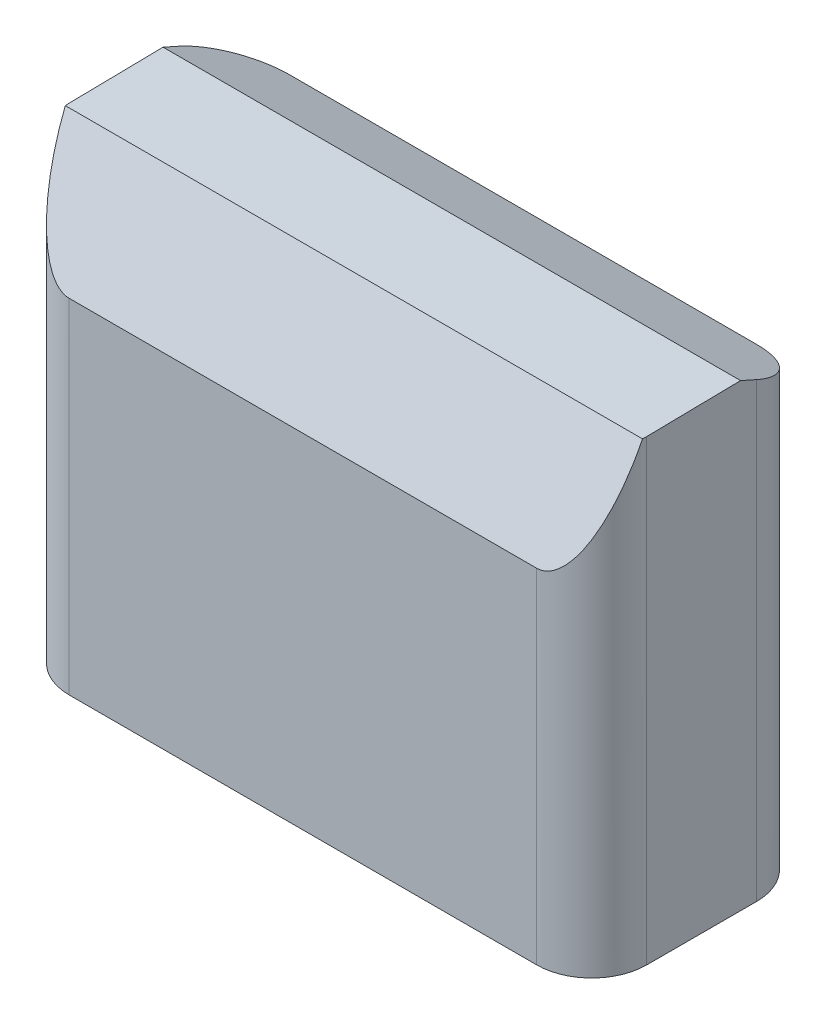
ISO-10303-21;
HEADER;
FILE_DESCRIPTION(('STEP AP214'),'2;1');
FILE_NAME('part.step','',(''),(''),'','','');
FILE_SCHEMA(('AUTOMOTIVE_DESIGN { 1 0 10303 214 1 1 1 1 }'));
ENDSEC;
DATA;
#1=APPLICATION_CONTEXT('core data for automotive mechanical design processes');
#2=APPLICATION_PROTOCOL_DEFINITION('international standard','automotive_design',2000,#1);
#3=PRODUCT_CONTEXT('',#1,'mechanical');
#4=PRODUCT('Part','Part','',(#3));
#5=PRODUCT_RELATED_PRODUCT_CATEGORY('part','',(#4));
#6=PRODUCT_DEFINITION_FORMATION('','',#4);
#7=PRODUCT_DEFINITION_CONTEXT('part definition',#1,'design');
#8=PRODUCT_DEFINITION('design','',#6,#7);
#9=PRODUCT_DEFINITION_SHAPE('','',#8);
#10=(LENGTH_UNIT() NAMED_UNIT(*) SI_UNIT(.MILLI.,.METRE.));
#11=(NAMED_UNIT(*) PLANE_ANGLE_UNIT() SI_UNIT($,.RADIAN.));
#12=(NAMED_UNIT(*) SI_UNIT($,.STERADIAN.) SOLID_ANGLE_UNIT());
#13=UNCERTAINTY_MEASURE_WITH_UNIT(LENGTH_MEASURE(1.E-05),#10,'distance_accuracy_value','');
#14=(GEOMETRIC_REPRESENTATION_CONTEXT(3) GLOBAL_UNCERTAINTY_ASSIGNED_CONTEXT((#13)) GLOBAL_UNIT_ASSIGNED_CONTEXT((#10,
#11,#12)) REPRESENTATION_CONTEXT('',''));
#15=CARTESIAN_POINT('',(0.,0.,0.));
#16=DIRECTION('',(0.,0.,1.));
#17=DIRECTION('',(1.,0.,0.));
#18=AXIS2_PLACEMENT_3D('',#15,#16,#17);
#19=CARTESIAN_POINT('',(-45.4997652654269,-58.8573743922204,40.));
#20=DIRECTION('',(0.,1.,0.));
#21=DIRECTION('',(0.,0.,1.));
#22=AXIS2_PLACEMENT_3D('',#19,#20,#21);
#23=PLANE('',#22);
#24=DIRECTION('',(0.,0.,-1.));
#25=VECTOR('',#24,1.);
#26=CARTESIAN_POINT('',(-45.4997652654269,-58.8573743922204,40.));
#27=LINE('',#26,#25);
#28=CARTESIAN_POINT('',(-45.4997652654269,-58.8573743922204,29.999999934));
#29=VERTEX_POINT('',#28);
#30=CARTESIAN_POINT('',(-45.4997652654269,-58.8573743922204,10.000000066));
#31=VERTEX_POINT('',#30);
#32=EDGE_CURVE('E138',#29,#31,#27,.T.);
#33=ORIENTED_EDGE('',*,*,#32,.T.);
#34=CARTESIAN_POINT('',(-35.4997651994269,-58.8573743922204,10.000000066));
#35=DIRECTION('',(0.,1.,0.));
#36=DIRECTION('',(0.,0.,1.));
#37=AXIS2_PLACEMENT_3D('',#34,#35,#36);
#38=CIRCLE('',#37,10.000000066);
#39=CARTESIAN_POINT('',(-35.4997651994269,-58.8573743922204,0.));
#40=VERTEX_POINT('',#39);
#41=EDGE_CURVE('E158',#31,#40,#38,.F.);
#42=ORIENTED_EDGE('',*,*,#41,.T.);
#43=DIRECTION('',(1.,0.,0.));
#44=VECTOR('',#43,1.);
#45=CARTESIAN_POINT('',(-45.4997652654269,-58.8573743922204,0.));
#46=LINE('',#45,#44);
#47=CARTESIAN_POINT('',(49.5002346685731,-58.8573743922204,0.));
#48=VERTEX_POINT('',#47);
#49=EDGE_CURVE('E196',#40,#48,#46,.T.);
#50=ORIENTED_EDGE('',*,*,#49,.T.);
#51=CARTESIAN_POINT('',(49.5002346685731,-58.8573743922204,10.000000066));
#52=DIRECTION('',(0.,1.,0.));
#53=DIRECTION('',(0.,0.,1.));
#54=AXIS2_PLACEMENT_3D('',#51,#52,#53);
#55=CIRCLE('',#54,10.000000066);
#56=CARTESIAN_POINT('',(59.5002347345731,-58.8573743922204,10.000000066));
#57=VERTEX_POINT('',#56);
#58=EDGE_CURVE('E137',#48,#57,#55,.F.);
#59=ORIENTED_EDGE('',*,*,#58,.T.);
#60=DIRECTION('',(0.,0.,-1.));
#61=VECTOR('',#60,1.);
#62=CARTESIAN_POINT('',(59.5002347345731,-58.8573743922204,40.));
#63=LINE('',#62,#61);
#64=CARTESIAN_POINT('',(59.5002347345731,-58.8573743922204,29.999999934));
#65=VERTEX_POINT('',#64);
#66=EDGE_CURVE('E118',#65,#57,#63,.T.);
#67=ORIENTED_EDGE('',*,*,#66,.F.);
#68=CARTESIAN_POINT('',(49.5002346685731,-58.8573743922204,29.999999934));
#69=DIRECTION('',(0.,1.,0.));
#70=DIRECTION('',(0.,0.,1.));
#71=AXIS2_PLACEMENT_3D('',#68,#69,#70);
#72=CIRCLE('',#71,10.000000066);
#73=CARTESIAN_POINT('',(49.5002346685731,-58.8573743922204,40.));
#74=VERTEX_POINT('',#73);
#75=EDGE_CURVE('E124',#65,#74,#72,.F.);
#76=ORIENTED_EDGE('',*,*,#75,.T.);
#77=DIRECTION('',(1.,0.,0.));
#78=VECTOR('',#77,1.);
#79=CARTESIAN_POINT('',(-45.4997652654269,-58.8573743922204,40.));
#80=LINE('',#79,#78);
#81=CARTESIAN_POINT('',(-35.4997651994269,-58.8573743922204,40.));
#82=VERTEX_POINT('',#81);
#83=EDGE_CURVE('E140',#82,#74,#80,.T.);
#84=ORIENTED_EDGE('',*,*,#83,.F.);
#85=CARTESIAN_POINT('',(-35.4997651994269,-58.8573743922204,29.999999934));
#86=DIRECTION('',(0.,1.,0.));
#87=DIRECTION('',(0.,0.,1.));
#88=AXIS2_PLACEMENT_3D('',#85,#86,#87);
#89=CIRCLE('',#88,10.000000066);
#90=EDGE_CURVE('E147',#82,#29,#89,.F.);
#91=ORIENTED_EDGE('',*,*,#90,.T.);
#92=EDGE_LOOP('',(#33,#42,#50,#59,#67,#76,#84,#91));
#93=FACE_BOUND('',#92,.T.);
#94=ADVANCED_FACE('F36',(#93),#23,.F.);
#95=CARTESIAN_POINT('',(59.5002347345731,31.1426256077796,40.));
#96=DIRECTION('',(1.,0.,0.));
#97=DIRECTION('',(0.,1.,0.));
#98=AXIS2_PLACEMENT_3D('',#95,#96,#97);
#99=PLANE('',#98);
#100=DIRECTION('',(0.,-0.407798932237558,-0.913071755595313));
#101=VECTOR('',#100,1.);
#102=CARTESIAN_POINT('',(59.5002347345731,35.7821027076506,37.9279023845892));
#103=LINE('',#102,#101);
#104=CARTESIAN_POINT('',(59.5002347345731,23.3088565740759,10.000000066));
#105=VERTEX_POINT('',#104);
#106=CARTESIAN_POINT('',(59.5002347345731,24.6211643907402,12.9382892750191));
#107=VERTEX_POINT('',#106);
#108=EDGE_CURVE('E168',#105,#107,#103,.F.);
#109=ORIENTED_EDGE('',*,*,#108,.T.);
#110=DIRECTION('',(0.,0.0162894503620875,-0.999867318101208));
#111=VECTOR('',#110,1.);
#112=CARTESIAN_POINT('',(59.5002347345731,24.1821329309667,39.8866023542304));
#113=LINE('',#112,#111);
#114=CARTESIAN_POINT('',(59.5002347345731,24.3432016212404,29.999999934));
#115=VERTEX_POINT('',#114);
#116=EDGE_CURVE('E121',#107,#115,#113,.F.);
#117=ORIENTED_EDGE('',*,*,#116,.T.);
#118=DIRECTION('',(0.,-1.,0.));
#119=VECTOR('',#118,1.);
#120=CARTESIAN_POINT('',(59.5002347345731,-58.8573743922204,29.999999934));
#121=LINE('',#120,#119);
#122=EDGE_CURVE('E112',#115,#65,#121,.T.);
#123=ORIENTED_EDGE('',*,*,#122,.T.);
#124=ORIENTED_EDGE('',*,*,#66,.T.);
#125=DIRECTION('',(0.,-1.,0.));
#126=VECTOR('',#125,1.);
#127=CARTESIAN_POINT('',(59.5002347345731,31.1426256077796,10.000000066));
#128=LINE('',#127,#126);
#129=EDGE_CURVE('E154',#57,#105,#128,.F.);
#130=ORIENTED_EDGE('',*,*,#129,.T.);
#131=EDGE_LOOP('',(#109,#117,#123,#124,#130));
#132=FACE_BOUND('',#131,.T.);
#133=ADVANCED_FACE('F115',(#132),#99,.T.);
#134=CARTESIAN_POINT('',(-45.4997652654269,31.1426256077796,40.));
#135=DIRECTION('',(1.,0.,0.));
#136=DIRECTION('',(0.,1.,0.));
#137=AXIS2_PLACEMENT_3D('',#134,#135,#136);
#138=PLANE('',#137);
#139=DIRECTION('',(0.,-1.,0.));
#140=VECTOR('',#139,1.);
#141=CARTESIAN_POINT('',(-45.4997652654269,31.1426256077796,29.999999934));
#142=LINE('',#141,#140);
#143=CARTESIAN_POINT('',(-45.4997652654269,24.3432016212404,29.999999934));
#144=VERTEX_POINT('',#143);
#145=EDGE_CURVE('E149',#29,#144,#142,.F.);
#146=ORIENTED_EDGE('',*,*,#145,.T.);
#147=DIRECTION('',(0.,-0.0162894503620875,0.999867318101208));
#148=VECTOR('',#147,1.);
#149=CARTESIAN_POINT('',(-45.4997652654269,31.1426256077796,-387.357349450669));
#150=LINE('',#149,#148);
#151=CARTESIAN_POINT('',(-45.4997652654269,24.6211643907402,12.9382892750192));
#152=VERTEX_POINT('',#151);
#153=EDGE_CURVE('E13',#144,#152,#150,.F.);
#154=ORIENTED_EDGE('',*,*,#153,.T.);
#155=DIRECTION('',(0.,0.407798932237558,0.913071755595313));
#156=VECTOR('',#155,1.);
#157=CARTESIAN_POINT('',(-45.4997652654269,18.8426256077796,0.));
#158=LINE('',#157,#156);
#159=CARTESIAN_POINT('',(-45.4997652654269,23.3088565740759,10.000000066));
#160=VERTEX_POINT('',#159);
#161=EDGE_CURVE('E170',#152,#160,#158,.F.);
#162=ORIENTED_EDGE('',*,*,#161,.T.);
#163=DIRECTION('',(0.,-1.,0.));
#164=VECTOR('',#163,1.);
#165=CARTESIAN_POINT('',(-45.4997652654269,-58.8573743922204,10.000000066));
#166=LINE('',#165,#164);
#167=EDGE_CURVE('E156',#160,#31,#166,.T.);
#168=ORIENTED_EDGE('',*,*,#167,.T.);
#169=ORIENTED_EDGE('',*,*,#32,.F.);
#170=EDGE_LOOP('',(#146,#154,#162,#168,#169));
#171=FACE_BOUND('',#170,.T.);
#172=ADVANCED_FACE('F213',(#171),#138,.F.);
#173=CARTESIAN_POINT('',(0.,0.,40.));
#174=DIRECTION('',(0.,0.,-1.));
#175=DIRECTION('',(-1.,0.,0.));
#176=AXIS2_PLACEMENT_3D('',#173,#174,#175);
#177=PLANE('',#176);
#178=DIRECTION('',(0.,-1.,0.));
#179=VECTOR('',#178,1.);
#180=CARTESIAN_POINT('',(49.5002346685731,31.1426256077796,40.));
#181=LINE('',#180,#179);
#182=CARTESIAN_POINT('',(49.5002346685731,3.6026256077796,40.));
#183=VERTEX_POINT('',#182);
#184=EDGE_CURVE('E130',#74,#183,#181,.F.);
#185=ORIENTED_EDGE('',*,*,#184,.T.);
#186=DIRECTION('',(-1.,0.,0.));
#187=VECTOR('',#186,1.);
#188=CARTESIAN_POINT('',(-35.4997651994269,3.6026256077796,40.));
#189=LINE('',#188,#187);
#190=CARTESIAN_POINT('',(-35.4997651994269,3.6026256077796,40.));
#191=VERTEX_POINT('',#190);
#192=EDGE_CURVE('E176',#183,#191,#189,.T.);
#193=ORIENTED_EDGE('',*,*,#192,.T.);
#194=DIRECTION('',(0.,-1.,0.));
#195=VECTOR('',#194,1.);
#196=CARTESIAN_POINT('',(-35.4997651994269,0.,40.));
#197=LINE('',#196,#195);
#198=EDGE_CURVE('E145',#191,#82,#197,.T.);
#199=ORIENTED_EDGE('',*,*,#198,.T.);
#200=ORIENTED_EDGE('',*,*,#83,.T.);
#201=EDGE_LOOP('',(#185,#193,#199,#200));
#202=FACE_BOUND('',#201,.T.);
#203=ADVANCED_FACE('F195',(#202),#177,.F.);
#204=CARTESIAN_POINT('',(0.,0.,0.));
#205=DIRECTION('',(0.,0.,-1.));
#206=DIRECTION('',(-1.,0.,0.));
#207=AXIS2_PLACEMENT_3D('',#204,#205,#206);
#208=PLANE('',#207);
#209=DIRECTION('',(0.,-1.,0.));
#210=VECTOR('',#209,1.);
#211=CARTESIAN_POINT('',(-35.4997651994269,31.1426256077796,0.));
#212=LINE('',#211,#210);
#213=CARTESIAN_POINT('',(-35.4997651994269,18.8426256077796,0.));
#214=VERTEX_POINT('',#213);
#215=EDGE_CURVE('E160',#40,#214,#212,.F.);
#216=ORIENTED_EDGE('',*,*,#215,.T.);
#217=DIRECTION('',(1.,0.,0.));
#218=VECTOR('',#217,1.);
#219=CARTESIAN_POINT('',(0.,18.8426256077796,0.));
#220=LINE('',#219,#218);
#221=CARTESIAN_POINT('',(49.5002346685731,18.8426256077796,0.));
#222=VERTEX_POINT('',#221);
#223=EDGE_CURVE('E163',#214,#222,#220,.T.);
#224=ORIENTED_EDGE('',*,*,#223,.T.);
#225=DIRECTION('',(0.,-1.,0.));
#226=VECTOR('',#225,1.);
#227=CARTESIAN_POINT('',(49.5002346685731,0.,0.));
#228=LINE('',#227,#226);
#229=EDGE_CURVE('E151',#222,#48,#228,.T.);
#230=ORIENTED_EDGE('',*,*,#229,.T.);
#231=ORIENTED_EDGE('',*,*,#49,.F.);
#232=EDGE_LOOP('',(#216,#224,#230,#231));
#233=FACE_BOUND('',#232,.T.);
#234=ADVANCED_FACE('F218',(#233),#208,.T.);
#235=CARTESIAN_POINT('',(49.5002346685731,31.1426256077796,29.999999934));
#236=DIRECTION('',(0.,1.,0.));
#237=DIRECTION('',(-1.,0.,0.));
#238=AXIS2_PLACEMENT_3D('',#235,#236,#237);
#239=CYLINDRICAL_SURFACE('',#238,10.000000066);
#240=ORIENTED_EDGE('',*,*,#122,.F.);
#241=CARTESIAN_POINT('',(49.5002346685731,24.3432016212404,29.999999934));
#242=DIRECTION('',(0.,-0.999867318101208,-0.0162894503620875));
#243=DIRECTION('',(0.,0.0162894503620875,-0.999867318101208));
#244=AXIS2_PLACEMENT_3D('',#241,#242,#243);
#245=ELLIPSE('',#244,10.0013270610649,10.000000066);
#246=CARTESIAN_POINT('',(59.4726551379693,24.3311103110357,30.7421800344935));
#247=VERTEX_POINT('',#246);
#248=EDGE_CURVE('E183',#115,#247,#245,.T.);
#249=ORIENTED_EDGE('',*,*,#248,.T.);
#250=CARTESIAN_POINT('',(49.5002346685731,25.9928696579942,29.999999934));
#251=DIRECTION('',(0.,0.407798932237558,0.913071755595313));
#252=DIRECTION('',(0.,0.913071755595313,-0.407798932237558));
#253=AXIS2_PLACEMENT_3D('',#250,#251,#252);
#254=ELLIPSE('',#253,24.5218887924273,10.000000066);
#255=EDGE_CURVE('E174',#247,#183,#254,.F.);
#256=ORIENTED_EDGE('',*,*,#255,.T.);
#257=ORIENTED_EDGE('',*,*,#184,.F.);
#258=ORIENTED_EDGE('',*,*,#75,.F.);
#259=EDGE_LOOP('',(#240,#249,#256,#257,#258));
#260=FACE_BOUND('',#259,.T.);
#261=ADVANCED_FACE('F128',(#260),#239,.T.);
#262=CARTESIAN_POINT('',(-35.4997651994269,0.,29.999999934));
#263=DIRECTION('',(0.,-1.,0.));
#264=DIRECTION('',(1.,0.,0.));
#265=AXIS2_PLACEMENT_3D('',#262,#263,#264);
#266=CYLINDRICAL_SURFACE('',#265,10.000000066);
#267=CARTESIAN_POINT('',(-35.4997651994269,25.9928696579942,29.999999934));
#268=DIRECTION('',(0.,0.407798932237558,0.913071755595313));
#269=DIRECTION('',(0.,-0.913071755595313,0.407798932237558));
#270=AXIS2_PLACEMENT_3D('',#267,#268,#269);
#271=ELLIPSE('',#270,24.5218887924273,10.000000066);
#272=CARTESIAN_POINT('',(-45.4721856688231,24.3311103110357,30.7421800344935));
#273=VERTEX_POINT('',#272);
#274=EDGE_CURVE('E178',#191,#273,#271,.F.);
#275=ORIENTED_EDGE('',*,*,#274,.T.);
#276=CARTESIAN_POINT('',(-35.4997651994269,24.3432016212404,29.999999934));
#277=DIRECTION('',(0.,-0.999867318101208,-0.0162894503620875));
#278=DIRECTION('',(0.,-0.0162894503620875,0.999867318101208));
#279=AXIS2_PLACEMENT_3D('',#276,#277,#278);
#280=ELLIPSE('',#279,10.0013270610649,10.000000066);
#281=EDGE_CURVE('E44',#273,#144,#280,.T.);
#282=ORIENTED_EDGE('',*,*,#281,.T.);
#283=ORIENTED_EDGE('',*,*,#145,.F.);
#284=ORIENTED_EDGE('',*,*,#90,.F.);
#285=ORIENTED_EDGE('',*,*,#198,.F.);
#286=EDGE_LOOP('',(#275,#282,#283,#284,#285));
#287=FACE_BOUND('',#286,.T.);
#288=ADVANCED_FACE('F192',(#287),#266,.T.);
#289=CARTESIAN_POINT('',(49.5002346685731,0.,10.000000066));
#290=DIRECTION('',(0.,-1.,0.));
#291=DIRECTION('',(1.,0.,0.));
#292=AXIS2_PLACEMENT_3D('',#289,#290,#291);
#293=CYLINDRICAL_SURFACE('',#292,10.000000066);
#294=ORIENTED_EDGE('',*,*,#229,.F.);
#295=CARTESIAN_POINT('',(49.5002346685731,23.3088565740759,10.000000066));
#296=DIRECTION('',(0.,-0.913071755595313,0.407798932237558));
#297=DIRECTION('',(0.,-0.407798932237558,-0.913071755595313));
#298=AXIS2_PLACEMENT_3D('',#295,#296,#297);
#299=ELLIPSE('',#298,10.9520418353978,10.000000066);
#300=EDGE_CURVE('E166',#222,#105,#299,.T.);
#301=ORIENTED_EDGE('',*,*,#300,.T.);
#302=ORIENTED_EDGE('',*,*,#129,.F.);
#303=ORIENTED_EDGE('',*,*,#58,.F.);
#304=EDGE_LOOP('',(#294,#301,#302,#303));
#305=FACE_BOUND('',#304,.T.);
#306=ADVANCED_FACE('F204',(#305),#293,.T.);
#307=CARTESIAN_POINT('',(-35.4997651994269,31.1426256077796,10.000000066));
#308=DIRECTION('',(0.,1.,0.));
#309=DIRECTION('',(-1.,0.,0.));
#310=AXIS2_PLACEMENT_3D('',#307,#308,#309);
#311=CYLINDRICAL_SURFACE('',#310,10.000000066);
#312=ORIENTED_EDGE('',*,*,#167,.F.);
#313=CARTESIAN_POINT('',(-35.4997651994269,23.3088565740759,10.000000066));
#314=DIRECTION('',(0.,-0.913071755595313,0.407798932237558));
#315=DIRECTION('',(0.,0.407798932237558,0.913071755595313));
#316=AXIS2_PLACEMENT_3D('',#313,#314,#315);
#317=ELLIPSE('',#316,10.9520418353978,10.000000066);
#318=EDGE_CURVE('E172',#160,#214,#317,.T.);
#319=ORIENTED_EDGE('',*,*,#318,.T.);
#320=ORIENTED_EDGE('',*,*,#215,.F.);
#321=ORIENTED_EDGE('',*,*,#41,.F.);
#322=EDGE_LOOP('',(#312,#319,#320,#321));
#323=FACE_BOUND('',#322,.T.);
#324=ADVANCED_FACE('F217',(#323),#311,.T.);
#325=CARTESIAN_POINT('',(0.,18.8426256077796,0.));
#326=DIRECTION('',(0.,-0.913071755595313,0.407798932237558));
#327=DIRECTION('',(1.,0.,0.));
#328=AXIS2_PLACEMENT_3D('',#325,#326,#327);
#329=PLANE('',#328);
#330=ORIENTED_EDGE('',*,*,#161,.F.);
#331=DIRECTION('',(1.,0.,0.));
#332=VECTOR('',#331,1.);
#333=CARTESIAN_POINT('',(0.,24.6211643907402,12.9382892750191));
#334=LINE('',#333,#332);
#335=EDGE_CURVE('E180',#152,#107,#334,.T.);
#336=ORIENTED_EDGE('',*,*,#335,.T.);
#337=ORIENTED_EDGE('',*,*,#108,.F.);
#338=ORIENTED_EDGE('',*,*,#300,.F.);
#339=ORIENTED_EDGE('',*,*,#223,.F.);
#340=ORIENTED_EDGE('',*,*,#318,.F.);
#341=EDGE_LOOP('',(#330,#336,#337,#338,#339,#340));
#342=FACE_BOUND('',#341,.T.);
#343=ADVANCED_FACE('F208',(#342),#329,.F.);
#344=CARTESIAN_POINT('',(-45.4997652654269,31.1426256077796,27.7));
#345=DIRECTION('',(0.,0.407798932237558,0.913071755595313));
#346=DIRECTION('',(-1.,0.,0.));
#347=AXIS2_PLACEMENT_3D('',#344,#345,#346);
#348=PLANE('',#347);
#349=ORIENTED_EDGE('',*,*,#255,.F.);
#350=DIRECTION('',(-1.,0.,0.));
#351=VECTOR('',#350,1.);
#352=CARTESIAN_POINT('',(-45.4997652654269,24.3311103110357,30.7421800344935));
#353=LINE('',#352,#351);
#354=EDGE_CURVE('E185',#247,#273,#353,.T.);
#355=ORIENTED_EDGE('',*,*,#354,.T.);
#356=ORIENTED_EDGE('',*,*,#274,.F.);
#357=ORIENTED_EDGE('',*,*,#192,.F.);
#358=EDGE_LOOP('',(#349,#355,#356,#357));
#359=FACE_BOUND('',#358,.T.);
#360=ADVANCED_FACE('F189',(#359),#348,.T.);
#361=CARTESIAN_POINT('',(-45.4997652654269,31.1426256077796,-387.357349450669));
#362=DIRECTION('',(0.,-0.999867318101208,-0.0162894503620875));
#363=DIRECTION('',(1.,0.,0.));
#364=AXIS2_PLACEMENT_3D('',#361,#362,#363);
#365=PLANE('',#364);
#366=ORIENTED_EDGE('',*,*,#281,.F.);
#367=ORIENTED_EDGE('',*,*,#354,.F.);
#368=ORIENTED_EDGE('',*,*,#248,.F.);
#369=ORIENTED_EDGE('',*,*,#116,.F.);
#370=ORIENTED_EDGE('',*,*,#335,.F.);
#371=ORIENTED_EDGE('',*,*,#153,.F.);
#372=EDGE_LOOP('',(#366,#367,#368,#369,#370,#371));
#373=FACE_BOUND('',#372,.T.);
#374=ADVANCED_FACE('F38',(#373),#365,.F.);
#375=CLOSED_SHELL('',(#94,#133,#172,#203,#234,#261,#288,#306,#324,#343,#360,#374));
#376=MANIFOLD_SOLID_BREP('B2',#375);
#377=ADVANCED_BREP_SHAPE_REPRESENTATION('',(#18,#376),#14);
#378=SHAPE_DEFINITION_REPRESENTATION(#9,#377);
ENDSEC;
END-ISO-10303-21;
